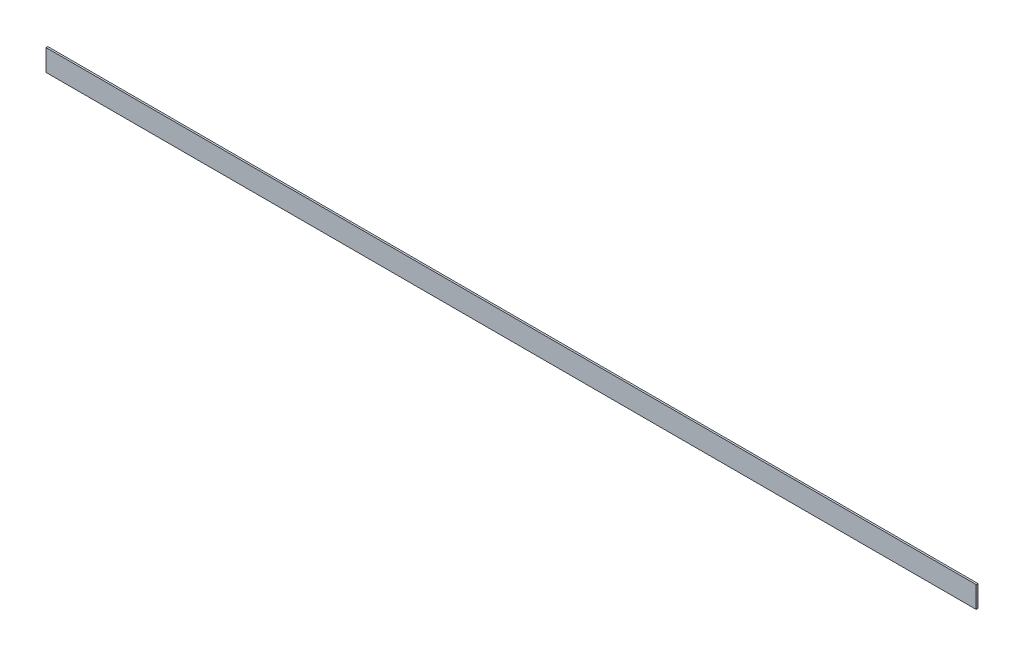
ISO-10303-21;
HEADER;
FILE_DESCRIPTION(('STEP AP214'),'2;1');
FILE_NAME('part.step','',(''),(''),'','','');
FILE_SCHEMA(('AUTOMOTIVE_DESIGN { 1 0 10303 214 1 1 1 1 }'));
ENDSEC;
DATA;
#1=APPLICATION_CONTEXT('core data for automotive mechanical design processes');
#2=APPLICATION_PROTOCOL_DEFINITION('international standard','automotive_design',2000,#1);
#3=PRODUCT_CONTEXT('',#1,'mechanical');
#4=PRODUCT('Part','Part','',(#3));
#5=PRODUCT_RELATED_PRODUCT_CATEGORY('part','',(#4));
#6=PRODUCT_DEFINITION_FORMATION('','',#4);
#7=PRODUCT_DEFINITION_CONTEXT('part definition',#1,'design');
#8=PRODUCT_DEFINITION('design','',#6,#7);
#9=PRODUCT_DEFINITION_SHAPE('','',#8);
#10=(LENGTH_UNIT() NAMED_UNIT(*) SI_UNIT(.MILLI.,.METRE.));
#11=(NAMED_UNIT(*) PLANE_ANGLE_UNIT() SI_UNIT($,.RADIAN.));
#12=(NAMED_UNIT(*) SI_UNIT($,.STERADIAN.) SOLID_ANGLE_UNIT());
#13=UNCERTAINTY_MEASURE_WITH_UNIT(LENGTH_MEASURE(1.E-05),#10,'distance_accuracy_value','');
#14=(GEOMETRIC_REPRESENTATION_CONTEXT(3) GLOBAL_UNCERTAINTY_ASSIGNED_CONTEXT((#13)) GLOBAL_UNIT_ASSIGNED_CONTEXT((#10,
#11,#12)) REPRESENTATION_CONTEXT('',''));
#15=CARTESIAN_POINT('',(0.,0.,0.));
#16=DIRECTION('',(0.,0.,1.));
#17=DIRECTION('',(1.,0.,0.));
#18=AXIS2_PLACEMENT_3D('',#15,#16,#17);
#19=CARTESIAN_POINT('',(0.,0.,0.));
#20=DIRECTION('',(0.,0.,1.));
#21=DIRECTION('',(1.,0.,0.));
#22=AXIS2_PLACEMENT_3D('',#19,#20,#21);
#23=PLANE('',#22);
#24=DIRECTION('',(0.,1.,0.));
#25=VECTOR('',#24,1.);
#26=CARTESIAN_POINT('',(-1644.65,38.1,0.));
#27=LINE('',#26,#25);
#28=CARTESIAN_POINT('',(-1644.65,38.1,0.));
#29=VERTEX_POINT('',#28);
#30=CARTESIAN_POINT('',(-1644.65,-38.1,0.));
#31=VERTEX_POINT('',#30);
#32=EDGE_CURVE('E79',#29,#31,#27,.F.);
#33=ORIENTED_EDGE('',*,*,#32,.F.);
#34=DIRECTION('',(1.,0.,0.));
#35=VECTOR('',#34,1.);
#36=CARTESIAN_POINT('',(1644.65,38.1,0.));
#37=LINE('',#36,#35);
#38=CARTESIAN_POINT('',(1644.65,38.1,0.));
#39=VERTEX_POINT('',#38);
#40=EDGE_CURVE('E55',#39,#29,#37,.F.);
#41=ORIENTED_EDGE('',*,*,#40,.F.);
#42=DIRECTION('',(0.,1.,0.));
#43=VECTOR('',#42,1.);
#44=CARTESIAN_POINT('',(1644.65,-38.1,0.));
#45=LINE('',#44,#43);
#46=CARTESIAN_POINT('',(1644.65,-38.1,0.));
#47=VERTEX_POINT('',#46);
#48=EDGE_CURVE('E57',#47,#39,#45,.T.);
#49=ORIENTED_EDGE('',*,*,#48,.F.);
#50=DIRECTION('',(1.,0.,0.));
#51=VECTOR('',#50,1.);
#52=CARTESIAN_POINT('',(-1644.65,-38.1,0.));
#53=LINE('',#52,#51);
#54=EDGE_CURVE('E20',#31,#47,#53,.T.);
#55=ORIENTED_EDGE('',*,*,#54,.F.);
#56=EDGE_LOOP('',(#33,#41,#49,#55));
#57=FACE_BOUND('',#56,.T.);
#58=ADVANCED_FACE('F17',(#57),#23,.F.);
#59=CARTESIAN_POINT('',(-1644.65,-38.1,0.));
#60=DIRECTION('',(0.,-1.,0.));
#61=DIRECTION('',(0.,0.,-1.));
#62=AXIS2_PLACEMENT_3D('',#59,#60,#61);
#63=PLANE('',#62);
#64=DIRECTION('',(1.,0.,0.));
#65=VECTOR('',#64,1.);
#66=CARTESIAN_POINT('',(0.,-38.1,6.35));
#67=LINE('',#66,#65);
#68=CARTESIAN_POINT('',(-1644.65,-38.1,6.35));
#69=VERTEX_POINT('',#68);
#70=CARTESIAN_POINT('',(1644.65,-38.1,6.35));
#71=VERTEX_POINT('',#70);
#72=EDGE_CURVE('E83',#69,#71,#67,.T.);
#73=ORIENTED_EDGE('',*,*,#72,.F.);
#74=DIRECTION('',(0.,0.,1.));
#75=VECTOR('',#74,1.);
#76=CARTESIAN_POINT('',(-1644.65,-38.1,0.));
#77=LINE('',#76,#75);
#78=EDGE_CURVE('E68',#31,#69,#77,.T.);
#79=ORIENTED_EDGE('',*,*,#78,.F.);
#80=ORIENTED_EDGE('',*,*,#54,.T.);
#81=DIRECTION('',(0.,0.,-1.));
#82=VECTOR('',#81,1.);
#83=CARTESIAN_POINT('',(1644.65,-38.1,0.));
#84=LINE('',#83,#82);
#85=EDGE_CURVE('E63',#71,#47,#84,.T.);
#86=ORIENTED_EDGE('',*,*,#85,.F.);
#87=EDGE_LOOP('',(#73,#79,#80,#86));
#88=FACE_BOUND('',#87,.T.);
#89=ADVANCED_FACE('F65',(#88),#63,.T.);
#90=CARTESIAN_POINT('',(1644.65,-38.1,0.));
#91=DIRECTION('',(1.,0.,0.));
#92=DIRECTION('',(0.,0.,-1.));
#93=AXIS2_PLACEMENT_3D('',#90,#91,#92);
#94=PLANE('',#93);
#95=DIRECTION('',(0.,1.,0.));
#96=VECTOR('',#95,1.);
#97=CARTESIAN_POINT('',(1644.65,0.,6.35));
#98=LINE('',#97,#96);
#99=CARTESIAN_POINT('',(1644.65,38.1,6.35));
#100=VERTEX_POINT('',#99);
#101=EDGE_CURVE('E72',#71,#100,#98,.T.);
#102=ORIENTED_EDGE('',*,*,#101,.F.);
#103=ORIENTED_EDGE('',*,*,#85,.T.);
#104=ORIENTED_EDGE('',*,*,#48,.T.);
#105=DIRECTION('',(0.,0.,1.));
#106=VECTOR('',#105,1.);
#107=CARTESIAN_POINT('',(1644.65,38.1,0.));
#108=LINE('',#107,#106);
#109=EDGE_CURVE('E75',#100,#39,#108,.F.);
#110=ORIENTED_EDGE('',*,*,#109,.F.);
#111=EDGE_LOOP('',(#102,#103,#104,#110));
#112=FACE_BOUND('',#111,.T.);
#113=ADVANCED_FACE('F70',(#112),#94,.T.);
#114=CARTESIAN_POINT('',(1644.65,38.1,0.));
#115=DIRECTION('',(0.,1.,0.));
#116=DIRECTION('',(0.,0.,1.));
#117=AXIS2_PLACEMENT_3D('',#114,#115,#116);
#118=PLANE('',#117);
#119=DIRECTION('',(1.,0.,0.));
#120=VECTOR('',#119,1.);
#121=CARTESIAN_POINT('',(0.,38.1,6.35));
#122=LINE('',#121,#120);
#123=CARTESIAN_POINT('',(-1644.65,38.1,6.35));
#124=VERTEX_POINT('',#123);
#125=EDGE_CURVE('E26',#100,#124,#122,.F.);
#126=ORIENTED_EDGE('',*,*,#125,.F.);
#127=ORIENTED_EDGE('',*,*,#109,.T.);
#128=ORIENTED_EDGE('',*,*,#40,.T.);
#129=DIRECTION('',(0.,0.,1.));
#130=VECTOR('',#129,1.);
#131=CARTESIAN_POINT('',(-1644.65,38.1,0.));
#132=LINE('',#131,#130);
#133=EDGE_CURVE('E35',#124,#29,#132,.F.);
#134=ORIENTED_EDGE('',*,*,#133,.F.);
#135=EDGE_LOOP('',(#126,#127,#128,#134));
#136=FACE_BOUND('',#135,.T.);
#137=ADVANCED_FACE('F89',(#136),#118,.T.);
#138=CARTESIAN_POINT('',(-1644.65,38.1,0.));
#139=DIRECTION('',(-1.,0.,0.));
#140=DIRECTION('',(0.,0.,1.));
#141=AXIS2_PLACEMENT_3D('',#138,#139,#140);
#142=PLANE('',#141);
#143=DIRECTION('',(0.,1.,0.));
#144=VECTOR('',#143,1.);
#145=CARTESIAN_POINT('',(-1644.65,0.,6.35));
#146=LINE('',#145,#144);
#147=EDGE_CURVE('E11',#124,#69,#146,.F.);
#148=ORIENTED_EDGE('',*,*,#147,.F.);
#149=ORIENTED_EDGE('',*,*,#133,.T.);
#150=ORIENTED_EDGE('',*,*,#32,.T.);
#151=ORIENTED_EDGE('',*,*,#78,.T.);
#152=EDGE_LOOP('',(#148,#149,#150,#151));
#153=FACE_BOUND('',#152,.T.);
#154=ADVANCED_FACE('F91',(#153),#142,.T.);
#155=CARTESIAN_POINT('',(0.,0.,6.35));
#156=DIRECTION('',(0.,0.,1.));
#157=DIRECTION('',(1.,0.,0.));
#158=AXIS2_PLACEMENT_3D('',#155,#156,#157);
#159=PLANE('',#158);
#160=ORIENTED_EDGE('',*,*,#125,.T.);
#161=ORIENTED_EDGE('',*,*,#147,.T.);
#162=ORIENTED_EDGE('',*,*,#72,.T.);
#163=ORIENTED_EDGE('',*,*,#101,.T.);
#164=EDGE_LOOP('',(#160,#161,#162,#163));
#165=FACE_BOUND('',#164,.T.);
#166=ADVANCED_FACE('F88',(#165),#159,.T.);
#167=CLOSED_SHELL('',(#58,#89,#113,#137,#154,#166));
#168=MANIFOLD_SOLID_BREP('B1',#167);
#169=ADVANCED_BREP_SHAPE_REPRESENTATION('',(#18,#168),#14);
#170=SHAPE_DEFINITION_REPRESENTATION(#9,#169);
ENDSEC;
END-ISO-10303-21;
